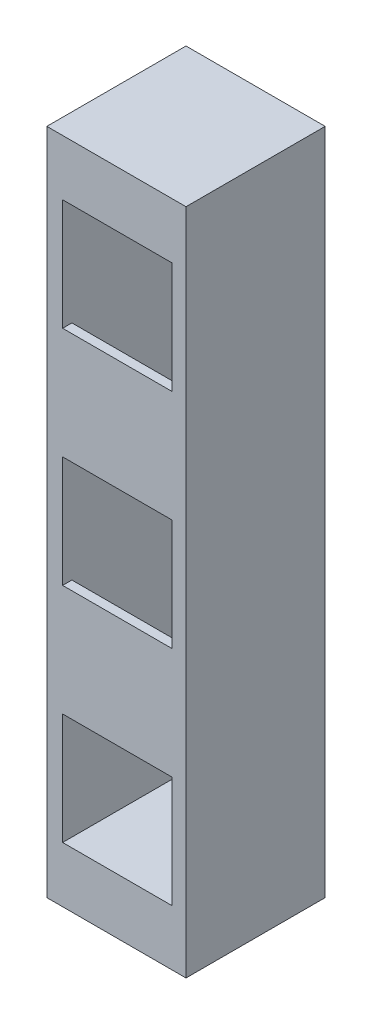
ISO-10303-21;
HEADER;
FILE_DESCRIPTION(('STEP AP214'),'2;1');
FILE_NAME('part.step','',(''),(''),'','','');
FILE_SCHEMA(('AUTOMOTIVE_DESIGN { 1 0 10303 214 1 1 1 1 }'));
ENDSEC;
DATA;
#1=APPLICATION_CONTEXT('core data for automotive mechanical design processes');
#2=APPLICATION_PROTOCOL_DEFINITION('international standard','automotive_design',2000,#1);
#3=PRODUCT_CONTEXT('',#1,'mechanical');
#4=PRODUCT('Part','Part','',(#3));
#5=PRODUCT_RELATED_PRODUCT_CATEGORY('part','',(#4));
#6=PRODUCT_DEFINITION_FORMATION('','',#4);
#7=PRODUCT_DEFINITION_CONTEXT('part definition',#1,'design');
#8=PRODUCT_DEFINITION('design','',#6,#7);
#9=PRODUCT_DEFINITION_SHAPE('','',#8);
#10=(LENGTH_UNIT() NAMED_UNIT(*) SI_UNIT(.MILLI.,.METRE.));
#11=(NAMED_UNIT(*) PLANE_ANGLE_UNIT() SI_UNIT($,.RADIAN.));
#12=(NAMED_UNIT(*) SI_UNIT($,.STERADIAN.) SOLID_ANGLE_UNIT());
#13=UNCERTAINTY_MEASURE_WITH_UNIT(LENGTH_MEASURE(1.E-05),#10,'distance_accuracy_value','');
#14=(GEOMETRIC_REPRESENTATION_CONTEXT(3) GLOBAL_UNCERTAINTY_ASSIGNED_CONTEXT((#13)) GLOBAL_UNIT_ASSIGNED_CONTEXT((#10,
#11,#12)) REPRESENTATION_CONTEXT('',''));
#15=CARTESIAN_POINT('',(0.,0.,0.));
#16=DIRECTION('',(0.,0.,1.));
#17=DIRECTION('',(1.,0.,0.));
#18=AXIS2_PLACEMENT_3D('',#15,#16,#17);
#19=CARTESIAN_POINT('',(0.,-228.6,-82.55));
#20=DIRECTION('',(0.,-1.,0.));
#21=DIRECTION('',(0.,0.,-1.));
#22=AXIS2_PLACEMENT_3D('',#19,#20,#21);
#23=PLANE('',#22);
#24=DIRECTION('',(0.,0.,1.));
#25=VECTOR('',#24,1.);
#26=CARTESIAN_POINT('',(-73.6599999999937,-228.6,-82.55));
#27=LINE('',#26,#25);
#28=CARTESIAN_POINT('',(-73.66,-228.6,82.55));
#29=VERTEX_POINT('',#28);
#30=CARTESIAN_POINT('',(-73.6599999999937,-228.6,95.25));
#31=VERTEX_POINT('',#30);
#32=EDGE_CURVE('E204',#29,#31,#27,.T.);
#33=ORIENTED_EDGE('',*,*,#32,.F.);
#34=DIRECTION('',(1.,0.,0.));
#35=VECTOR('',#34,1.);
#36=CARTESIAN_POINT('',(0.,-228.6,82.55));
#37=LINE('',#36,#35);
#38=CARTESIAN_POINT('',(76.2000000000063,-228.6,82.55));
#39=VERTEX_POINT('',#38);
#40=EDGE_CURVE('E151',#29,#39,#37,.T.);
#41=ORIENTED_EDGE('',*,*,#40,.T.);
#42=DIRECTION('',(0.,0.,1.));
#43=VECTOR('',#42,1.);
#44=CARTESIAN_POINT('',(76.2000000000063,-228.6,-82.55));
#45=LINE('',#44,#43);
#46=CARTESIAN_POINT('',(76.2000000000063,-228.6,95.25));
#47=VERTEX_POINT('',#46);
#48=EDGE_CURVE('E162',#39,#47,#45,.T.);
#49=ORIENTED_EDGE('',*,*,#48,.T.);
#50=DIRECTION('',(1.,0.,0.));
#51=VECTOR('',#50,1.);
#52=CARTESIAN_POINT('',(0.,-228.6,95.25));
#53=LINE('',#52,#51);
#54=EDGE_CURVE('E191',#31,#47,#53,.T.);
#55=ORIENTED_EDGE('',*,*,#54,.F.);
#56=EDGE_LOOP('',(#33,#41,#49,#55));
#57=FACE_BOUND('',#56,.T.);
#58=ADVANCED_FACE('F37',(#57),#23,.T.);
#59=CARTESIAN_POINT('',(0.,-76.2,-82.55));
#60=DIRECTION('',(0.,-1.,0.));
#61=DIRECTION('',(0.,0.,-1.));
#62=AXIS2_PLACEMENT_3D('',#59,#60,#61);
#63=PLANE('',#62);
#64=DIRECTION('',(1.,0.,0.));
#65=VECTOR('',#64,1.);
#66=CARTESIAN_POINT('',(0.,-76.2,82.55));
#67=LINE('',#66,#65);
#68=CARTESIAN_POINT('',(-73.6599999999968,-76.2,82.55));
#69=VERTEX_POINT('',#68);
#70=CARTESIAN_POINT('',(76.2,-76.2,82.55));
#71=VERTEX_POINT('',#70);
#72=EDGE_CURVE('E146',#69,#71,#67,.T.);
#73=ORIENTED_EDGE('',*,*,#72,.F.);
#74=DIRECTION('',(0.,0.,1.));
#75=VECTOR('',#74,1.);
#76=CARTESIAN_POINT('',(-73.6599999999968,-76.2,-82.55));
#77=LINE('',#76,#75);
#78=CARTESIAN_POINT('',(-73.6599999999968,-76.2,95.25));
#79=VERTEX_POINT('',#78);
#80=EDGE_CURVE('E171',#69,#79,#77,.T.);
#81=ORIENTED_EDGE('',*,*,#80,.T.);
#82=DIRECTION('',(1.,0.,0.));
#83=VECTOR('',#82,1.);
#84=CARTESIAN_POINT('',(0.,-76.2,95.25));
#85=LINE('',#84,#83);
#86=CARTESIAN_POINT('',(76.2000000000032,-76.2,95.25));
#87=VERTEX_POINT('',#86);
#88=EDGE_CURVE('E168',#79,#87,#85,.T.);
#89=ORIENTED_EDGE('',*,*,#88,.T.);
#90=DIRECTION('',(0.,0.,1.));
#91=VECTOR('',#90,1.);
#92=CARTESIAN_POINT('',(76.2000000000032,-76.2,-82.55));
#93=LINE('',#92,#91);
#94=EDGE_CURVE('E159',#71,#87,#93,.T.);
#95=ORIENTED_EDGE('',*,*,#94,.F.);
#96=EDGE_LOOP('',(#73,#81,#89,#95));
#97=FACE_BOUND('',#96,.T.);
#98=ADVANCED_FACE('F166',(#97),#63,.F.);
#99=CARTESIAN_POINT('',(0.,76.2,-82.55));
#100=DIRECTION('',(0.,-1.,0.));
#101=DIRECTION('',(0.,0.,-1.));
#102=AXIS2_PLACEMENT_3D('',#99,#100,#101);
#103=PLANE('',#102);
#104=DIRECTION('',(0.,0.,1.));
#105=VECTOR('',#104,1.);
#106=CARTESIAN_POINT('',(-73.6599999999968,76.2,-82.55));
#107=LINE('',#106,#105);
#108=CARTESIAN_POINT('',(-73.66,76.2,82.55));
#109=VERTEX_POINT('',#108);
#110=CARTESIAN_POINT('',(-73.6599999999968,76.2,95.25));
#111=VERTEX_POINT('',#110);
#112=EDGE_CURVE('E176',#109,#111,#107,.T.);
#113=ORIENTED_EDGE('',*,*,#112,.F.);
#114=DIRECTION('',(1.,0.,0.));
#115=VECTOR('',#114,1.);
#116=CARTESIAN_POINT('',(0.,76.2,82.55));
#117=LINE('',#116,#115);
#118=CARTESIAN_POINT('',(76.2000000000032,76.2,82.55));
#119=VERTEX_POINT('',#118);
#120=EDGE_CURVE('E152',#109,#119,#117,.T.);
#121=ORIENTED_EDGE('',*,*,#120,.T.);
#122=DIRECTION('',(0.,0.,1.));
#123=VECTOR('',#122,1.);
#124=CARTESIAN_POINT('',(76.2000000000032,76.2,-82.55));
#125=LINE('',#124,#123);
#126=CARTESIAN_POINT('',(76.2000000000032,76.2,95.25));
#127=VERTEX_POINT('',#126);
#128=EDGE_CURVE('E182',#119,#127,#125,.T.);
#129=ORIENTED_EDGE('',*,*,#128,.T.);
#130=DIRECTION('',(1.,0.,0.));
#131=VECTOR('',#130,1.);
#132=CARTESIAN_POINT('',(0.,76.2,95.25));
#133=LINE('',#132,#131);
#134=EDGE_CURVE('E487',#111,#127,#133,.T.);
#135=ORIENTED_EDGE('',*,*,#134,.F.);
#136=EDGE_LOOP('',(#113,#121,#129,#135));
#137=FACE_BOUND('',#136,.T.);
#138=ADVANCED_FACE('F266',(#137),#103,.T.);
#139=CARTESIAN_POINT('',(0.,228.6,-82.55));
#140=DIRECTION('',(0.,-1.,0.));
#141=DIRECTION('',(0.,0.,-1.));
#142=AXIS2_PLACEMENT_3D('',#139,#140,#141);
#143=PLANE('',#142);
#144=DIRECTION('',(1.,0.,0.));
#145=VECTOR('',#144,1.);
#146=CARTESIAN_POINT('',(0.,228.6,82.55));
#147=LINE('',#146,#145);
#148=CARTESIAN_POINT('',(-73.66,228.6,82.55));
#149=VERTEX_POINT('',#148);
#150=CARTESIAN_POINT('',(76.2,228.6,82.55));
#151=VERTEX_POINT('',#150);
#152=EDGE_CURVE('E163',#149,#151,#147,.T.);
#153=ORIENTED_EDGE('',*,*,#152,.F.);
#154=DIRECTION('',(0.,0.,1.));
#155=VECTOR('',#154,1.);
#156=CARTESIAN_POINT('',(-73.66,228.6,-82.55));
#157=LINE('',#156,#155);
#158=CARTESIAN_POINT('',(-73.66,228.6,95.25));
#159=VERTEX_POINT('',#158);
#160=EDGE_CURVE('E495',#149,#159,#157,.T.);
#161=ORIENTED_EDGE('',*,*,#160,.T.);
#162=DIRECTION('',(1.,0.,0.));
#163=VECTOR('',#162,1.);
#164=CARTESIAN_POINT('',(0.,228.6,95.25));
#165=LINE('',#164,#163);
#166=CARTESIAN_POINT('',(76.2,228.6,95.25));
#167=VERTEX_POINT('',#166);
#168=EDGE_CURVE('E512',#159,#167,#165,.T.);
#169=ORIENTED_EDGE('',*,*,#168,.T.);
#170=DIRECTION('',(0.,0.,1.));
#171=VECTOR('',#170,1.);
#172=CARTESIAN_POINT('',(76.2,228.6,-82.55));
#173=LINE('',#172,#171);
#174=EDGE_CURVE('E518',#151,#167,#173,.T.);
#175=ORIENTED_EDGE('',*,*,#174,.F.);
#176=EDGE_LOOP('',(#153,#161,#169,#175));
#177=FACE_BOUND('',#176,.T.);
#178=ADVANCED_FACE('F275',(#177),#143,.F.);
#179=CARTESIAN_POINT('',(0.,0.,95.25));
#180=DIRECTION('',(0.,0.,1.));
#181=DIRECTION('',(1.,0.,0.));
#182=AXIS2_PLACEMENT_3D('',#179,#180,#181);
#183=PLANE('',#182);
#184=DIRECTION('',(0.,1.,0.));
#185=VECTOR('',#184,1.);
#186=CARTESIAN_POINT('',(95.2499999999999,457.2,95.25));
#187=LINE('',#186,#185);
#188=CARTESIAN_POINT('',(95.25,-457.2,95.25));
#189=VERTEX_POINT('',#188);
#190=CARTESIAN_POINT('',(95.2499999999999,457.2,95.25));
#191=VERTEX_POINT('',#190);
#192=EDGE_CURVE('E207',#189,#191,#187,.T.);
#193=ORIENTED_EDGE('',*,*,#192,.T.);
#194=DIRECTION('',(-1.,0.,0.));
#195=VECTOR('',#194,1.);
#196=CARTESIAN_POINT('',(-95.2500000000001,457.2,95.25));
#197=LINE('',#196,#195);
#198=CARTESIAN_POINT('',(-95.2500000000001,457.2,95.25));
#199=VERTEX_POINT('',#198);
#200=EDGE_CURVE('E210',#191,#199,#197,.T.);
#201=ORIENTED_EDGE('',*,*,#200,.T.);
#202=DIRECTION('',(0.,-1.,0.));
#203=VECTOR('',#202,1.);
#204=CARTESIAN_POINT('',(-95.2500000000001,457.2,95.25));
#205=LINE('',#204,#203);
#206=CARTESIAN_POINT('',(-95.25,-457.2,95.25));
#207=VERTEX_POINT('',#206);
#208=EDGE_CURVE('E213',#199,#207,#205,.T.);
#209=ORIENTED_EDGE('',*,*,#208,.T.);
#210=DIRECTION('',(1.,0.,0.));
#211=VECTOR('',#210,1.);
#212=CARTESIAN_POINT('',(-95.25,-457.2,95.25));
#213=LINE('',#212,#211);
#214=EDGE_CURVE('E215',#207,#189,#213,.T.);
#215=ORIENTED_EDGE('',*,*,#214,.T.);
#216=EDGE_LOOP('',(#193,#201,#209,#215));
#217=FACE_BOUND('',#216,.T.);
#218=ORIENTED_EDGE('',*,*,#54,.T.);
#219=DIRECTION('',(0.,-1.,0.));
#220=VECTOR('',#219,1.);
#221=CARTESIAN_POINT('',(76.2000000000063,0.,95.25));
#222=LINE('',#221,#220);
#223=CARTESIAN_POINT('',(76.2000000000063,-381.,95.25));
#224=VERTEX_POINT('',#223);
#225=EDGE_CURVE('E188',#47,#224,#222,.T.);
#226=ORIENTED_EDGE('',*,*,#225,.T.);
#227=DIRECTION('',(1.,0.,0.));
#228=VECTOR('',#227,1.);
#229=CARTESIAN_POINT('',(0.,-381.,95.25));
#230=LINE('',#229,#228);
#231=CARTESIAN_POINT('',(-73.6599999999937,-381.,95.25));
#232=VERTEX_POINT('',#231);
#233=EDGE_CURVE('E187',#232,#224,#230,.T.);
#234=ORIENTED_EDGE('',*,*,#233,.F.);
#235=DIRECTION('',(0.,-1.,0.));
#236=VECTOR('',#235,1.);
#237=CARTESIAN_POINT('',(-73.6599999999937,0.,95.25));
#238=LINE('',#237,#236);
#239=EDGE_CURVE('E194',#31,#232,#238,.T.);
#240=ORIENTED_EDGE('',*,*,#239,.F.);
#241=EDGE_LOOP('',(#218,#226,#234,#240));
#242=FACE_BOUND('',#241,.T.);
#243=ORIENTED_EDGE('',*,*,#134,.T.);
#244=DIRECTION('',(0.,-1.,0.));
#245=VECTOR('',#244,1.);
#246=CARTESIAN_POINT('',(76.2000000000032,0.,95.25));
#247=LINE('',#246,#245);
#248=EDGE_CURVE('E201',#127,#87,#247,.T.);
#249=ORIENTED_EDGE('',*,*,#248,.T.);
#250=ORIENTED_EDGE('',*,*,#88,.F.);
#251=DIRECTION('',(0.,-1.,0.));
#252=VECTOR('',#251,1.);
#253=CARTESIAN_POINT('',(-73.6599999999968,0.,95.25));
#254=LINE('',#253,#252);
#255=EDGE_CURVE('E491',#111,#79,#254,.T.);
#256=ORIENTED_EDGE('',*,*,#255,.F.);
#257=EDGE_LOOP('',(#243,#249,#250,#256));
#258=FACE_BOUND('',#257,.T.);
#259=DIRECTION('',(0.,-1.,0.));
#260=VECTOR('',#259,1.);
#261=CARTESIAN_POINT('',(-73.66,0.,95.25));
#262=LINE('',#261,#260);
#263=CARTESIAN_POINT('',(-73.66,381.,95.25));
#264=VERTEX_POINT('',#263);
#265=EDGE_CURVE('E174',#264,#159,#262,.T.);
#266=ORIENTED_EDGE('',*,*,#265,.F.);
#267=DIRECTION('',(1.,0.,0.));
#268=VECTOR('',#267,1.);
#269=CARTESIAN_POINT('',(0.,381.,95.25));
#270=LINE('',#269,#268);
#271=CARTESIAN_POINT('',(76.2,381.,95.25));
#272=VERTEX_POINT('',#271);
#273=EDGE_CURVE('E170',#264,#272,#270,.T.);
#274=ORIENTED_EDGE('',*,*,#273,.T.);
#275=DIRECTION('',(0.,-1.,0.));
#276=VECTOR('',#275,1.);
#277=CARTESIAN_POINT('',(76.2,0.,95.25));
#278=LINE('',#277,#276);
#279=EDGE_CURVE('E506',#272,#167,#278,.T.);
#280=ORIENTED_EDGE('',*,*,#279,.T.);
#281=ORIENTED_EDGE('',*,*,#168,.F.);
#282=EDGE_LOOP('',(#266,#274,#280,#281));
#283=FACE_BOUND('',#282,.T.);
#284=ADVANCED_FACE('F251',(#217,#242,#258,#283),#183,.T.);
#285=CARTESIAN_POINT('',(95.2499999999999,457.2,95.25));
#286=DIRECTION('',(-1.,0.,0.));
#287=DIRECTION('',(0.,-1.,0.));
#288=AXIS2_PLACEMENT_3D('',#285,#286,#287);
#289=PLANE('',#288);
#290=DIRECTION('',(0.,1.,0.));
#291=VECTOR('',#290,1.);
#292=CARTESIAN_POINT('',(95.2499999999999,457.2,-95.25));
#293=LINE('',#292,#291);
#294=CARTESIAN_POINT('',(95.25,-457.2,-95.25));
#295=VERTEX_POINT('',#294);
#296=CARTESIAN_POINT('',(95.2499999999999,457.2,-95.25));
#297=VERTEX_POINT('',#296);
#298=EDGE_CURVE('E218',#295,#297,#293,.T.);
#299=ORIENTED_EDGE('',*,*,#298,.T.);
#300=DIRECTION('',(0.,0.,-1.));
#301=VECTOR('',#300,1.);
#302=CARTESIAN_POINT('',(95.2499999999999,457.2,95.25));
#303=LINE('',#302,#301);
#304=EDGE_CURVE('E11',#191,#297,#303,.T.);
#305=ORIENTED_EDGE('',*,*,#304,.F.);
#306=ORIENTED_EDGE('',*,*,#192,.F.);
#307=DIRECTION('',(0.,0.,-1.));
#308=VECTOR('',#307,1.);
#309=CARTESIAN_POINT('',(95.25,-457.2,95.25));
#310=LINE('',#309,#308);
#311=EDGE_CURVE('E217',#189,#295,#310,.T.);
#312=ORIENTED_EDGE('',*,*,#311,.T.);
#313=EDGE_LOOP('',(#299,#305,#306,#312));
#314=FACE_BOUND('',#313,.T.);
#315=ADVANCED_FACE('F39',(#314),#289,.F.);
#316=CARTESIAN_POINT('',(-95.2500000000001,457.2,95.25));
#317=DIRECTION('',(0.,-1.,0.));
#318=DIRECTION('',(0.,0.,-1.));
#319=AXIS2_PLACEMENT_3D('',#316,#317,#318);
#320=PLANE('',#319);
#321=DIRECTION('',(-1.,0.,0.));
#322=VECTOR('',#321,1.);
#323=CARTESIAN_POINT('',(-95.2500000000001,457.2,-95.25));
#324=LINE('',#323,#322);
#325=CARTESIAN_POINT('',(-95.2500000000001,457.2,-95.25));
#326=VERTEX_POINT('',#325);
#327=EDGE_CURVE('E221',#297,#326,#324,.T.);
#328=ORIENTED_EDGE('',*,*,#327,.T.);
#329=DIRECTION('',(0.,0.,-1.));
#330=VECTOR('',#329,1.);
#331=CARTESIAN_POINT('',(-95.2500000000001,457.2,95.25));
#332=LINE('',#331,#330);
#333=EDGE_CURVE('E45',#199,#326,#332,.T.);
#334=ORIENTED_EDGE('',*,*,#333,.F.);
#335=ORIENTED_EDGE('',*,*,#200,.F.);
#336=ORIENTED_EDGE('',*,*,#304,.T.);
#337=EDGE_LOOP('',(#328,#334,#335,#336));
#338=FACE_BOUND('',#337,.T.);
#339=ADVANCED_FACE('F253',(#338),#320,.F.);
#340=CARTESIAN_POINT('',(-95.2500000000001,457.2,95.25));
#341=DIRECTION('',(1.,0.,0.));
#342=DIRECTION('',(0.,1.,0.));
#343=AXIS2_PLACEMENT_3D('',#340,#341,#342);
#344=PLANE('',#343);
#345=DIRECTION('',(0.,-1.,0.));
#346=VECTOR('',#345,1.);
#347=CARTESIAN_POINT('',(-95.2500000000001,457.2,-95.25));
#348=LINE('',#347,#346);
#349=CARTESIAN_POINT('',(-95.25,-457.2,-95.25));
#350=VERTEX_POINT('',#349);
#351=EDGE_CURVE('E224',#326,#350,#348,.T.);
#352=ORIENTED_EDGE('',*,*,#351,.T.);
#353=DIRECTION('',(0.,0.,-1.));
#354=VECTOR('',#353,1.);
#355=CARTESIAN_POINT('',(-95.25,-457.2,95.25));
#356=LINE('',#355,#354);
#357=EDGE_CURVE('E229',#207,#350,#356,.T.);
#358=ORIENTED_EDGE('',*,*,#357,.F.);
#359=ORIENTED_EDGE('',*,*,#208,.F.);
#360=ORIENTED_EDGE('',*,*,#333,.T.);
#361=EDGE_LOOP('',(#352,#358,#359,#360));
#362=FACE_BOUND('',#361,.T.);
#363=ADVANCED_FACE('F236',(#362),#344,.F.);
#364=CARTESIAN_POINT('',(-95.25,-457.2,95.25));
#365=DIRECTION('',(0.,1.,0.));
#366=DIRECTION('',(0.,0.,1.));
#367=AXIS2_PLACEMENT_3D('',#364,#365,#366);
#368=PLANE('',#367);
#369=DIRECTION('',(1.,0.,0.));
#370=VECTOR('',#369,1.);
#371=CARTESIAN_POINT('',(-95.25,-457.2,-95.25));
#372=LINE('',#371,#370);
#373=EDGE_CURVE('E211',#350,#295,#372,.T.);
#374=ORIENTED_EDGE('',*,*,#373,.T.);
#375=ORIENTED_EDGE('',*,*,#311,.F.);
#376=ORIENTED_EDGE('',*,*,#214,.F.);
#377=ORIENTED_EDGE('',*,*,#357,.T.);
#378=EDGE_LOOP('',(#374,#375,#376,#377));
#379=FACE_BOUND('',#378,.T.);
#380=ADVANCED_FACE('F245',(#379),#368,.F.);
#381=CARTESIAN_POINT('',(0.,0.,-95.25));
#382=DIRECTION('',(0.,0.,1.));
#383=DIRECTION('',(1.,0.,0.));
#384=AXIS2_PLACEMENT_3D('',#381,#382,#383);
#385=PLANE('',#384);
#386=ORIENTED_EDGE('',*,*,#298,.F.);
#387=ORIENTED_EDGE('',*,*,#373,.F.);
#388=ORIENTED_EDGE('',*,*,#351,.F.);
#389=ORIENTED_EDGE('',*,*,#327,.F.);
#390=EDGE_LOOP('',(#386,#387,#388,#389));
#391=FACE_BOUND('',#390,.T.);
#392=ADVANCED_FACE('F242',(#391),#385,.F.);
#393=CARTESIAN_POINT('',(0.,-381.,-82.55));
#394=DIRECTION('',(0.,-1.,0.));
#395=DIRECTION('',(0.,0.,-1.));
#396=AXIS2_PLACEMENT_3D('',#393,#394,#395);
#397=PLANE('',#396);
#398=DIRECTION('',(0.,0.,1.));
#399=VECTOR('',#398,1.);
#400=CARTESIAN_POINT('',(-73.6599999999937,-381.,-82.55));
#401=LINE('',#400,#399);
#402=CARTESIAN_POINT('',(-73.6599999999937,-381.,-82.55));
#403=VERTEX_POINT('',#402);
#404=EDGE_CURVE('E202',#403,#232,#401,.T.);
#405=ORIENTED_EDGE('',*,*,#404,.T.);
#406=ORIENTED_EDGE('',*,*,#233,.T.);
#407=DIRECTION('',(0.,0.,1.));
#408=VECTOR('',#407,1.);
#409=CARTESIAN_POINT('',(76.2000000000063,-381.,-82.55));
#410=LINE('',#409,#408);
#411=CARTESIAN_POINT('',(76.2000000000063,-381.,-82.55));
#412=VERTEX_POINT('',#411);
#413=EDGE_CURVE('E199',#412,#224,#410,.T.);
#414=ORIENTED_EDGE('',*,*,#413,.F.);
#415=DIRECTION('',(1.,0.,0.));
#416=VECTOR('',#415,1.);
#417=CARTESIAN_POINT('',(0.,-381.,-82.55));
#418=LINE('',#417,#416);
#419=EDGE_CURVE('E184',#403,#412,#418,.T.);
#420=ORIENTED_EDGE('',*,*,#419,.F.);
#421=EDGE_LOOP('',(#405,#406,#414,#420));
#422=FACE_BOUND('',#421,.T.);
#423=ADVANCED_FACE('F271',(#422),#397,.F.);
#424=CARTESIAN_POINT('',(0.,381.,-82.55));
#425=DIRECTION('',(0.,-1.,0.));
#426=DIRECTION('',(0.,0.,-1.));
#427=AXIS2_PLACEMENT_3D('',#424,#425,#426);
#428=PLANE('',#427);
#429=DIRECTION('',(0.,0.,1.));
#430=VECTOR('',#429,1.);
#431=CARTESIAN_POINT('',(76.2,381.,-82.55));
#432=LINE('',#431,#430);
#433=CARTESIAN_POINT('',(76.2,381.,-82.55));
#434=VERTEX_POINT('',#433);
#435=EDGE_CURVE('E222',#434,#272,#432,.T.);
#436=ORIENTED_EDGE('',*,*,#435,.T.);
#437=ORIENTED_EDGE('',*,*,#273,.F.);
#438=DIRECTION('',(0.,0.,1.));
#439=VECTOR('',#438,1.);
#440=CARTESIAN_POINT('',(-73.66,381.,-82.55));
#441=LINE('',#440,#439);
#442=CARTESIAN_POINT('',(-73.66,381.,-82.55));
#443=VERTEX_POINT('',#442);
#444=EDGE_CURVE('E509',#443,#264,#441,.T.);
#445=ORIENTED_EDGE('',*,*,#444,.F.);
#446=DIRECTION('',(1.,0.,0.));
#447=VECTOR('',#446,1.);
#448=CARTESIAN_POINT('',(0.,381.,-82.55));
#449=LINE('',#448,#447);
#450=EDGE_CURVE('E502',#443,#434,#449,.T.);
#451=ORIENTED_EDGE('',*,*,#450,.T.);
#452=EDGE_LOOP('',(#436,#437,#445,#451));
#453=FACE_BOUND('',#452,.T.);
#454=ADVANCED_FACE('F294',(#453),#428,.T.);
#455=CARTESIAN_POINT('',(76.2,0.,-82.55));
#456=DIRECTION('',(-1.,0.,0.));
#457=DIRECTION('',(0.,0.,1.));
#458=AXIS2_PLACEMENT_3D('',#455,#456,#457);
#459=PLANE('',#458);
#460=DIRECTION('',(0.,1.,0.));
#461=VECTOR('',#460,1.);
#462=CARTESIAN_POINT('',(76.2,-381.,82.55));
#463=LINE('',#462,#461);
#464=EDGE_CURVE('E164',#119,#151,#463,.T.);
#465=ORIENTED_EDGE('',*,*,#464,.T.);
#466=ORIENTED_EDGE('',*,*,#174,.T.);
#467=ORIENTED_EDGE('',*,*,#279,.F.);
#468=ORIENTED_EDGE('',*,*,#435,.F.);
#469=DIRECTION('',(0.,-1.,0.));
#470=VECTOR('',#469,1.);
#471=CARTESIAN_POINT('',(76.2,0.,-82.55));
#472=LINE('',#471,#470);
#473=EDGE_CURVE('E508',#434,#412,#472,.T.);
#474=ORIENTED_EDGE('',*,*,#473,.T.);
#475=ORIENTED_EDGE('',*,*,#413,.T.);
#476=ORIENTED_EDGE('',*,*,#225,.F.);
#477=ORIENTED_EDGE('',*,*,#48,.F.);
#478=EDGE_CURVE('E52',#39,#71,#463,.T.);
#479=ORIENTED_EDGE('',*,*,#478,.T.);
#480=ORIENTED_EDGE('',*,*,#94,.T.);
#481=ORIENTED_EDGE('',*,*,#248,.F.);
#482=ORIENTED_EDGE('',*,*,#128,.F.);
#483=EDGE_LOOP('',(#465,#466,#467,#468,#474,#475,#476,#477,#479,#480,#481,#482));
#484=FACE_BOUND('',#483,.T.);
#485=ADVANCED_FACE('F157',(#484),#459,.T.);
#486=CARTESIAN_POINT('',(-73.66,0.,-82.55));
#487=DIRECTION('',(-1.,0.,0.));
#488=DIRECTION('',(0.,0.,1.));
#489=AXIS2_PLACEMENT_3D('',#486,#487,#488);
#490=PLANE('',#489);
#491=ORIENTED_EDGE('',*,*,#444,.T.);
#492=ORIENTED_EDGE('',*,*,#265,.T.);
#493=ORIENTED_EDGE('',*,*,#160,.F.);
#494=DIRECTION('',(0.,1.,0.));
#495=VECTOR('',#494,1.);
#496=CARTESIAN_POINT('',(-73.66,-381.,82.55));
#497=LINE('',#496,#495);
#498=EDGE_CURVE('E493',#109,#149,#497,.T.);
#499=ORIENTED_EDGE('',*,*,#498,.F.);
#500=ORIENTED_EDGE('',*,*,#112,.T.);
#501=ORIENTED_EDGE('',*,*,#255,.T.);
#502=ORIENTED_EDGE('',*,*,#80,.F.);
#503=EDGE_CURVE('E57',#29,#69,#497,.T.);
#504=ORIENTED_EDGE('',*,*,#503,.F.);
#505=ORIENTED_EDGE('',*,*,#32,.T.);
#506=ORIENTED_EDGE('',*,*,#239,.T.);
#507=ORIENTED_EDGE('',*,*,#404,.F.);
#508=DIRECTION('',(0.,-1.,0.));
#509=VECTOR('',#508,1.);
#510=CARTESIAN_POINT('',(-73.66,0.,-82.55));
#511=LINE('',#510,#509);
#512=EDGE_CURVE('E505',#443,#403,#511,.T.);
#513=ORIENTED_EDGE('',*,*,#512,.F.);
#514=EDGE_LOOP('',(#491,#492,#493,#499,#500,#501,#502,#504,#505,#506,#507,#513));
#515=FACE_BOUND('',#514,.T.);
#516=ADVANCED_FACE('F309',(#515),#490,.F.);
#517=CARTESIAN_POINT('',(0.,0.,-82.55));
#518=DIRECTION('',(0.,0.,1.));
#519=DIRECTION('',(1.,0.,0.));
#520=AXIS2_PLACEMENT_3D('',#517,#518,#519);
#521=PLANE('',#520);
#522=ORIENTED_EDGE('',*,*,#450,.F.);
#523=ORIENTED_EDGE('',*,*,#512,.T.);
#524=ORIENTED_EDGE('',*,*,#419,.T.);
#525=ORIENTED_EDGE('',*,*,#473,.F.);
#526=EDGE_LOOP('',(#522,#523,#524,#525));
#527=FACE_BOUND('',#526,.T.);
#528=ADVANCED_FACE('F316',(#527),#521,.T.);
#529=CARTESIAN_POINT('',(-73.66,-381.,82.55));
#530=DIRECTION('',(0.,0.,-1.));
#531=DIRECTION('',(-1.,0.,0.));
#532=AXIS2_PLACEMENT_3D('',#529,#530,#531);
#533=PLANE('',#532);
#534=ORIENTED_EDGE('',*,*,#498,.T.);
#535=ORIENTED_EDGE('',*,*,#152,.T.);
#536=ORIENTED_EDGE('',*,*,#464,.F.);
#537=ORIENTED_EDGE('',*,*,#120,.F.);
#538=EDGE_LOOP('',(#534,#535,#536,#537));
#539=FACE_BOUND('',#538,.T.);
#540=ADVANCED_FACE('F324',(#539),#533,.T.);
#541=ORIENTED_EDGE('',*,*,#503,.T.);
#542=ORIENTED_EDGE('',*,*,#72,.T.);
#543=ORIENTED_EDGE('',*,*,#478,.F.);
#544=ORIENTED_EDGE('',*,*,#40,.F.);
#545=EDGE_LOOP('',(#541,#542,#543,#544));
#546=FACE_BOUND('',#545,.T.);
#547=ADVANCED_FACE('F147',(#546),#533,.T.);
#548=CLOSED_SHELL('',(#58,#98,#138,#178,#284,#315,#339,#363,#380,#392,#423,#454,#485,#516,#528,
#540,#547));
#549=MANIFOLD_SOLID_BREP('B2',#548);
#550=ADVANCED_BREP_SHAPE_REPRESENTATION('',(#18,#549),#14);
#551=SHAPE_DEFINITION_REPRESENTATION(#9,#550);
ENDSEC;
END-ISO-10303-21;
